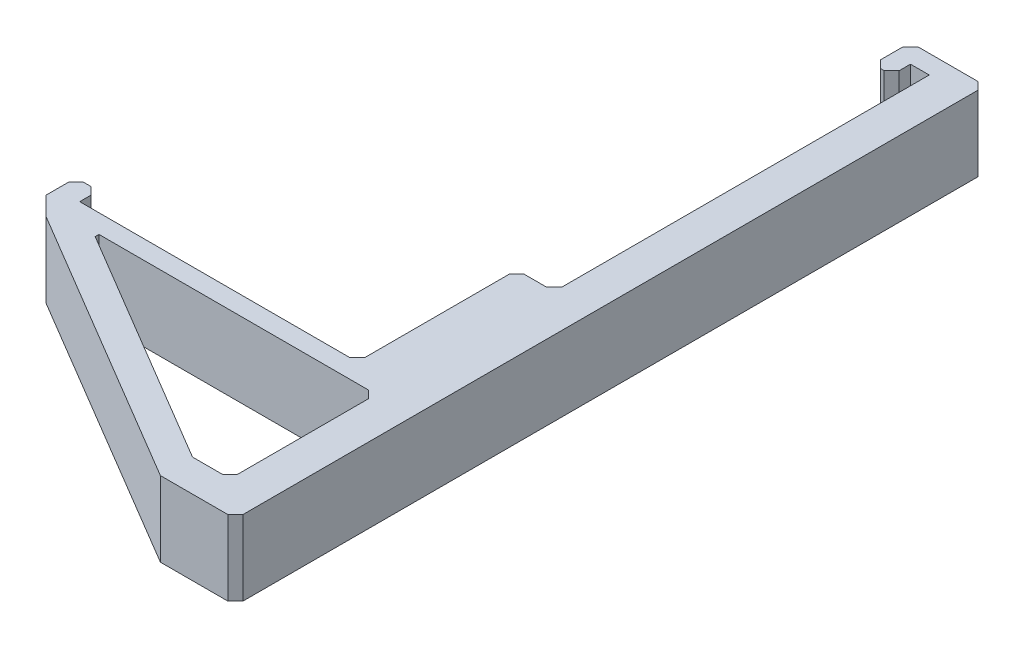
ISO-10303-21;
HEADER;
FILE_DESCRIPTION(('STEP AP214'),'2;1');
FILE_NAME('part.step','',(''),(''),'','','');
FILE_SCHEMA(('AUTOMOTIVE_DESIGN { 1 0 10303 214 1 1 1 1 }'));
ENDSEC;
DATA;
#1=APPLICATION_CONTEXT('core data for automotive mechanical design processes');
#2=APPLICATION_PROTOCOL_DEFINITION('international standard','automotive_design',2000,#1);
#3=PRODUCT_CONTEXT('',#1,'mechanical');
#4=PRODUCT('Part','Part','',(#3));
#5=PRODUCT_RELATED_PRODUCT_CATEGORY('part','',(#4));
#6=PRODUCT_DEFINITION_FORMATION('','',#4);
#7=PRODUCT_DEFINITION_CONTEXT('part definition',#1,'design');
#8=PRODUCT_DEFINITION('design','',#6,#7);
#9=PRODUCT_DEFINITION_SHAPE('','',#8);
#10=(LENGTH_UNIT() NAMED_UNIT(*) SI_UNIT(.MILLI.,.METRE.));
#11=(NAMED_UNIT(*) PLANE_ANGLE_UNIT() SI_UNIT($,.RADIAN.));
#12=(NAMED_UNIT(*) SI_UNIT($,.STERADIAN.) SOLID_ANGLE_UNIT());
#13=UNCERTAINTY_MEASURE_WITH_UNIT(LENGTH_MEASURE(1.E-05),#10,'distance_accuracy_value','');
#14=(GEOMETRIC_REPRESENTATION_CONTEXT(3) GLOBAL_UNCERTAINTY_ASSIGNED_CONTEXT((#13)) GLOBAL_UNIT_ASSIGNED_CONTEXT((#10,
#11,#12)) REPRESENTATION_CONTEXT('',''));
#15=CARTESIAN_POINT('',(0.,0.,0.));
#16=DIRECTION('',(0.,0.,1.));
#17=DIRECTION('',(1.,0.,0.));
#18=AXIS2_PLACEMENT_3D('',#15,#16,#17);
#19=CARTESIAN_POINT('',(0.,10.,0.));
#20=DIRECTION('',(0.,-1.,0.));
#21=DIRECTION('',(0.,0.,-1.));
#22=AXIS2_PLACEMENT_3D('',#19,#20,#21);
#23=PLANE('',#22);
#24=DIRECTION('',(1.,0.,0.));
#25=VECTOR('',#24,1.);
#26=CARTESIAN_POINT('',(-5.,10.,50.));
#27=LINE('',#26,#25);
#28=CARTESIAN_POINT('',(-5.,10.,50.));
#29=VERTEX_POINT('',#28);
#30=CARTESIAN_POINT('',(4.,10.,50.));
#31=VERTEX_POINT('',#30);
#32=EDGE_CURVE('E323',#29,#31,#27,.T.);
#33=ORIENTED_EDGE('',*,*,#32,.T.);
#34=DIRECTION('',(-0.707106781186548,0.,0.707106781186548));
#35=VECTOR('',#34,1.);
#36=CARTESIAN_POINT('',(5.,10.,49.));
#37=LINE('',#36,#35);
#38=CARTESIAN_POINT('',(5.,10.,49.));
#39=VERTEX_POINT('',#38);
#40=EDGE_CURVE('E428',#31,#39,#37,.F.);
#41=ORIENTED_EDGE('',*,*,#40,.T.);
#42=DIRECTION('',(0.,0.,-1.));
#43=VECTOR('',#42,1.);
#44=CARTESIAN_POINT('',(5.,10.,50.));
#45=LINE('',#44,#43);
#46=CARTESIAN_POINT('',(5.,10.,-49.));
#47=VERTEX_POINT('',#46);
#48=EDGE_CURVE('E284',#39,#47,#45,.T.);
#49=ORIENTED_EDGE('',*,*,#48,.T.);
#50=DIRECTION('',(0.70710678118655,0.,0.707106781186545));
#51=VECTOR('',#50,1.);
#52=CARTESIAN_POINT('',(3.99999999999998,10.,-50.));
#53=LINE('',#52,#51);
#54=CARTESIAN_POINT('',(3.99999999999998,10.,-50.));
#55=VERTEX_POINT('',#54);
#56=EDGE_CURVE('E426',#47,#55,#53,.F.);
#57=ORIENTED_EDGE('',*,*,#56,.T.);
#58=DIRECTION('',(-1.,0.,0.));
#59=VECTOR('',#58,1.);
#60=CARTESIAN_POINT('',(-5.,10.,-50.));
#61=LINE('',#60,#59);
#62=CARTESIAN_POINT('',(-3.99999999999999,10.,-50.));
#63=VERTEX_POINT('',#62);
#64=EDGE_CURVE('E287',#55,#63,#61,.T.);
#65=ORIENTED_EDGE('',*,*,#64,.T.);
#66=DIRECTION('',(0.707106781186552,0.,-0.707106781186543));
#67=VECTOR('',#66,1.);
#68=CARTESIAN_POINT('',(-5.,10.,-49.));
#69=LINE('',#68,#67);
#70=CARTESIAN_POINT('',(-5.,10.,-49.));
#71=VERTEX_POINT('',#70);
#72=EDGE_CURVE('E424',#63,#71,#69,.F.);
#73=ORIENTED_EDGE('',*,*,#72,.T.);
#74=DIRECTION('',(0.,0.,1.));
#75=VECTOR('',#74,1.);
#76=CARTESIAN_POINT('',(-5.,10.,-45.));
#77=LINE('',#76,#75);
#78=CARTESIAN_POINT('',(-5.,10.,-46.));
#79=VERTEX_POINT('',#78);
#80=EDGE_CURVE('E291',#71,#79,#77,.T.);
#81=ORIENTED_EDGE('',*,*,#80,.T.);
#82=DIRECTION('',(-0.707106781186548,0.,-0.707106781186548));
#83=VECTOR('',#82,1.);
#84=CARTESIAN_POINT('',(-3.99999999999996,10.,-45.));
#85=LINE('',#84,#83);
#86=CARTESIAN_POINT('',(-3.99999999999996,10.,-45.));
#87=VERTEX_POINT('',#86);
#88=EDGE_CURVE('E420',#79,#87,#85,.F.);
#89=ORIENTED_EDGE('',*,*,#88,.T.);
#90=DIRECTION('',(1.,0.,0.));
#91=VECTOR('',#90,1.);
#92=CARTESIAN_POINT('',(-2.5,10.,-45.));
#93=LINE('',#92,#91);
#94=CARTESIAN_POINT('',(-3.50000000000001,10.,-45.));
#95=VERTEX_POINT('',#94);
#96=EDGE_CURVE('E294',#87,#95,#93,.T.);
#97=ORIENTED_EDGE('',*,*,#96,.T.);
#98=DIRECTION('',(-0.707106781186552,0.,0.707106781186543));
#99=VECTOR('',#98,1.);
#100=CARTESIAN_POINT('',(-2.5,10.,-46.));
#101=LINE('',#100,#99);
#102=CARTESIAN_POINT('',(-2.5,10.,-46.));
#103=VERTEX_POINT('',#102);
#104=EDGE_CURVE('E422',#95,#103,#101,.F.);
#105=ORIENTED_EDGE('',*,*,#104,.T.);
#106=DIRECTION('',(0.,0.,-1.));
#107=VECTOR('',#106,1.);
#108=CARTESIAN_POINT('',(-2.5,10.,-45.));
#109=LINE('',#108,#107);
#110=CARTESIAN_POINT('',(-2.5,10.,-47.5));
#111=VERTEX_POINT('',#110);
#112=EDGE_CURVE('E297',#103,#111,#109,.T.);
#113=ORIENTED_EDGE('',*,*,#112,.T.);
#114=DIRECTION('',(1.,0.,0.));
#115=VECTOR('',#114,1.);
#116=CARTESIAN_POINT('',(0.,10.,-47.5));
#117=LINE('',#116,#115);
#118=CARTESIAN_POINT('',(0.,10.,-47.5));
#119=VERTEX_POINT('',#118);
#120=EDGE_CURVE('E299',#111,#119,#117,.T.);
#121=ORIENTED_EDGE('',*,*,#120,.T.);
#122=DIRECTION('',(0.,0.,1.));
#123=VECTOR('',#122,1.);
#124=CARTESIAN_POINT('',(0.,10.,-45.));
#125=LINE('',#124,#123);
#126=CARTESIAN_POINT('',(0.,10.,1.50000000000002));
#127=VERTEX_POINT('',#126);
#128=EDGE_CURVE('E301',#119,#127,#125,.T.);
#129=ORIENTED_EDGE('',*,*,#128,.T.);
#130=DIRECTION('',(0.707106781186552,0.,-0.707106781186543));
#131=VECTOR('',#130,1.);
#132=CARTESIAN_POINT('',(0.75000000000001,10.,0.750000000000021));
#133=LINE('',#132,#131);
#134=CARTESIAN_POINT('',(-1.00000000000002,10.,2.50000000000002));
#135=VERTEX_POINT('',#134);
#136=EDGE_CURVE('E487',#127,#135,#133,.F.);
#137=ORIENTED_EDGE('',*,*,#136,.T.);
#138=DIRECTION('',(-1.,0.,0.));
#139=VECTOR('',#138,1.);
#140=CARTESIAN_POINT('',(0.,10.,2.50000000000002));
#141=LINE('',#140,#139);
#142=CARTESIAN_POINT('',(-4.,10.,2.50000000000002));
#143=VERTEX_POINT('',#142);
#144=EDGE_CURVE('E304',#135,#143,#141,.T.);
#145=ORIENTED_EDGE('',*,*,#144,.T.);
#146=DIRECTION('',(0.707106781186547,0.,-0.707106781186548));
#147=VECTOR('',#146,1.);
#148=CARTESIAN_POINT('',(-5.,10.,3.50000000000002));
#149=LINE('',#148,#147);
#150=CARTESIAN_POINT('',(-5.,10.,3.50000000000002));
#151=VERTEX_POINT('',#150);
#152=EDGE_CURVE('E418',#143,#151,#149,.F.);
#153=ORIENTED_EDGE('',*,*,#152,.T.);
#154=DIRECTION('',(0.,0.,1.));
#155=VECTOR('',#154,1.);
#156=CARTESIAN_POINT('',(-5.,10.,2.50000000000002));
#157=LINE('',#156,#155);
#158=CARTESIAN_POINT('',(-5.,10.,22.75));
#159=VERTEX_POINT('',#158);
#160=EDGE_CURVE('E307',#151,#159,#157,.T.);
#161=ORIENTED_EDGE('',*,*,#160,.T.);
#162=DIRECTION('',(0.707106781186552,0.,-0.707106781186543));
#163=VECTOR('',#162,1.);
#164=CARTESIAN_POINT('',(8.87500000000004,10.,8.87500000000017));
#165=LINE('',#164,#163);
#166=CARTESIAN_POINT('',(-6.00000000000001,10.,23.75));
#167=VERTEX_POINT('',#166);
#168=EDGE_CURVE('E11',#159,#167,#165,.F.);
#169=ORIENTED_EDGE('',*,*,#168,.T.);
#170=DIRECTION('',(-1.,0.,0.));
#171=VECTOR('',#170,1.);
#172=CARTESIAN_POINT('',(-5.,10.,23.75));
#173=LINE('',#172,#171);
#174=CARTESIAN_POINT('',(-42.0041080187701,10.,23.75));
#175=VERTEX_POINT('',#174);
#176=EDGE_CURVE('E310',#167,#175,#173,.T.);
#177=ORIENTED_EDGE('',*,*,#176,.T.);
#178=DIRECTION('',(0.,0.,-1.));
#179=VECTOR('',#178,1.);
#180=CARTESIAN_POINT('',(-42.0041080187701,10.,21.25));
#181=LINE('',#180,#179);
#182=CARTESIAN_POINT('',(-42.0041080187701,10.,22.25));
#183=VERTEX_POINT('',#182);
#184=EDGE_CURVE('E312',#175,#183,#181,.T.);
#185=ORIENTED_EDGE('',*,*,#184,.T.);
#186=DIRECTION('',(0.707106781186543,0.,0.707106781186552));
#187=VECTOR('',#186,1.);
#188=CARTESIAN_POINT('',(-43.0041080187701,10.,21.25));
#189=LINE('',#188,#187);
#190=CARTESIAN_POINT('',(-43.0041080187701,10.,21.25));
#191=VERTEX_POINT('',#190);
#192=EDGE_CURVE('E412',#183,#191,#189,.F.);
#193=ORIENTED_EDGE('',*,*,#192,.T.);
#194=DIRECTION('',(-1.,0.,0.));
#195=VECTOR('',#194,1.);
#196=CARTESIAN_POINT('',(-45.,10.,21.25));
#197=LINE('',#196,#195);
#198=CARTESIAN_POINT('',(-44.,10.,21.25));
#199=VERTEX_POINT('',#198);
#200=EDGE_CURVE('E315',#191,#199,#197,.T.);
#201=ORIENTED_EDGE('',*,*,#200,.T.);
#202=DIRECTION('',(0.707106781186548,0.,-0.707106781186548));
#203=VECTOR('',#202,1.);
#204=CARTESIAN_POINT('',(-45.,10.,22.25));
#205=LINE('',#204,#203);
#206=CARTESIAN_POINT('',(-45.,10.,22.25));
#207=VERTEX_POINT('',#206);
#208=EDGE_CURVE('E414',#199,#207,#205,.F.);
#209=ORIENTED_EDGE('',*,*,#208,.T.);
#210=DIRECTION('',(0.,0.,1.));
#211=VECTOR('',#210,1.);
#212=CARTESIAN_POINT('',(-45.,10.,26.25));
#213=LINE('',#212,#211);
#214=CARTESIAN_POINT('',(-45.,10.,25.25));
#215=VERTEX_POINT('',#214);
#216=EDGE_CURVE('E318',#207,#215,#213,.T.);
#217=ORIENTED_EDGE('',*,*,#216,.T.);
#218=DIRECTION('',(-0.707106781186544,0.,-0.707106781186552));
#219=VECTOR('',#218,1.);
#220=CARTESIAN_POINT('',(-42.5384615384616,10.,27.7115384615384));
#221=LINE('',#220,#219);
#222=CARTESIAN_POINT('',(-42.5384615384616,10.,27.7115384615384));
#223=VERTEX_POINT('',#222);
#224=EDGE_CURVE('E416',#215,#223,#221,.F.);
#225=ORIENTED_EDGE('',*,*,#224,.T.);
#226=DIRECTION('',(0.859854743840735,0.,0.510538754155436));
#227=VECTOR('',#226,1.);
#228=CARTESIAN_POINT('',(-45.,10.,26.25));
#229=LINE('',#228,#227);
#230=EDGE_CURVE('E321',#223,#29,#229,.T.);
#231=ORIENTED_EDGE('',*,*,#230,.T.);
#232=EDGE_LOOP('',(#33,#41,#49,#57,#65,#73,#81,#89,#97,#105,#113,#121,#129,#137,#145,#153,#161,
#169,#177,#185,#193,#201,#209,#217,#225,#231));
#233=FACE_BOUND('',#232,.T.);
#234=DIRECTION('',(0.,0.,-1.));
#235=VECTOR('',#234,1.);
#236=CARTESIAN_POINT('',(0.,10.,26.25));
#237=LINE('',#236,#235);
#238=CARTESIAN_POINT('',(0.,10.,44.7211891361448));
#239=VERTEX_POINT('',#238);
#240=CARTESIAN_POINT('',(0.,10.,27.25));
#241=VERTEX_POINT('',#240);
#242=EDGE_CURVE('E277',#239,#241,#237,.T.);
#243=ORIENTED_EDGE('',*,*,#242,.F.);
#244=DIRECTION('',(0.707106781186552,0.,-0.707106781186543));
#245=VECTOR('',#244,1.);
#246=CARTESIAN_POINT('',(22.3605945680724,10.,22.3605945680727));
#247=LINE('',#246,#245);
#248=CARTESIAN_POINT('',(-1.00000000000001,10.,45.7211891361448));
#249=VERTEX_POINT('',#248);
#250=EDGE_CURVE('E59',#239,#249,#247,.F.);
#251=ORIENTED_EDGE('',*,*,#250,.T.);
#252=DIRECTION('',(1.,0.,0.));
#253=VECTOR('',#252,1.);
#254=CARTESIAN_POINT('',(-5.,10.,45.7211891361448));
#255=LINE('',#254,#253);
#256=CARTESIAN_POINT('',(-5.,10.,45.7211891361448));
#257=VERTEX_POINT('',#256);
#258=EDGE_CURVE('E271',#257,#249,#255,.T.);
#259=ORIENTED_EDGE('',*,*,#258,.F.);
#260=DIRECTION('',(0.859854743840734,0.,0.510538754155436));
#261=VECTOR('',#260,1.);
#262=CARTESIAN_POINT('',(-37.7935817029806,10.,26.25));
#263=LINE('',#262,#261);
#264=CARTESIAN_POINT('',(-36.9337269591399,10.,26.7605387541555));
#265=VERTEX_POINT('',#264);
#266=EDGE_CURVE('E268',#265,#257,#263,.T.);
#267=ORIENTED_EDGE('',*,*,#266,.F.);
#268=DIRECTION('',(-0.0122121587947025,0.,0.999925428808355));
#269=VECTOR('',#268,1.);
#270=CARTESIAN_POINT('',(-36.6014392019232,10.,-0.447015922158533));
#271=LINE('',#270,#269);
#272=CARTESIAN_POINT('',(-36.9274917138336,10.,26.25));
#273=VERTEX_POINT('',#272);
#274=EDGE_CURVE('E384',#265,#273,#271,.F.);
#275=ORIENTED_EDGE('',*,*,#274,.T.);
#276=DIRECTION('',(-1.,0.,0.));
#277=VECTOR('',#276,1.);
#278=CARTESIAN_POINT('',(-37.7935817029806,10.,26.25));
#279=LINE('',#278,#277);
#280=CARTESIAN_POINT('',(-1.,10.,26.25));
#281=VERTEX_POINT('',#280);
#282=EDGE_CURVE('E280',#281,#273,#279,.T.);
#283=ORIENTED_EDGE('',*,*,#282,.F.);
#284=DIRECTION('',(-0.707106781186542,0.,-0.707106781186553));
#285=VECTOR('',#284,1.);
#286=CARTESIAN_POINT('',(-13.625,10.,13.6249999999998));
#287=LINE('',#286,#285);
#288=EDGE_CURVE('E494',#281,#241,#287,.F.);
#289=ORIENTED_EDGE('',*,*,#288,.T.);
#290=EDGE_LOOP('',(#243,#251,#259,#267,#275,#283,#289));
#291=FACE_BOUND('',#290,.T.);
#292=ADVANCED_FACE('F35',(#233,#291),#23,.F.);
#293=CARTESIAN_POINT('',(0.,0.,0.));
#294=DIRECTION('',(0.,-1.,0.));
#295=DIRECTION('',(0.,0.,-1.));
#296=AXIS2_PLACEMENT_3D('',#293,#294,#295);
#297=PLANE('',#296);
#298=DIRECTION('',(0.,0.,-1.));
#299=VECTOR('',#298,1.);
#300=CARTESIAN_POINT('',(5.,0.,50.));
#301=LINE('',#300,#299);
#302=CARTESIAN_POINT('',(5.,0.,49.));
#303=VERTEX_POINT('',#302);
#304=CARTESIAN_POINT('',(5.,0.,-49.));
#305=VERTEX_POINT('',#304);
#306=EDGE_CURVE('E270',#303,#305,#301,.T.);
#307=ORIENTED_EDGE('',*,*,#306,.F.);
#308=DIRECTION('',(0.707106781186548,0.,-0.707106781186548));
#309=VECTOR('',#308,1.);
#310=CARTESIAN_POINT('',(27.,0.,27.));
#311=LINE('',#310,#309);
#312=CARTESIAN_POINT('',(4.,0.,50.));
#313=VERTEX_POINT('',#312);
#314=EDGE_CURVE('E408',#303,#313,#311,.F.);
#315=ORIENTED_EDGE('',*,*,#314,.T.);
#316=DIRECTION('',(1.,0.,0.));
#317=VECTOR('',#316,1.);
#318=CARTESIAN_POINT('',(-5.,0.,50.));
#319=LINE('',#318,#317);
#320=CARTESIAN_POINT('',(-5.,0.,50.));
#321=VERTEX_POINT('',#320);
#322=EDGE_CURVE('E288',#321,#313,#319,.T.);
#323=ORIENTED_EDGE('',*,*,#322,.F.);
#324=DIRECTION('',(0.859854743840735,0.,0.510538754155436));
#325=VECTOR('',#324,1.);
#326=CARTESIAN_POINT('',(-45.,0.,26.25));
#327=LINE('',#326,#325);
#328=CARTESIAN_POINT('',(-42.5384615384616,0.,27.7115384615384));
#329=VERTEX_POINT('',#328);
#330=EDGE_CURVE('E363',#329,#321,#327,.T.);
#331=ORIENTED_EDGE('',*,*,#330,.F.);
#332=DIRECTION('',(0.707106781186544,0.,0.707106781186552));
#333=VECTOR('',#332,1.);
#334=CARTESIAN_POINT('',(-35.1250000000003,0.,35.1249999999999));
#335=LINE('',#334,#333);
#336=CARTESIAN_POINT('',(-45.,0.,25.25));
#337=VERTEX_POINT('',#336);
#338=EDGE_CURVE('E396',#329,#337,#335,.F.);
#339=ORIENTED_EDGE('',*,*,#338,.T.);
#340=DIRECTION('',(0.,0.,1.));
#341=VECTOR('',#340,1.);
#342=CARTESIAN_POINT('',(-45.,0.,26.25));
#343=LINE('',#342,#341);
#344=CARTESIAN_POINT('',(-45.,0.,22.25));
#345=VERTEX_POINT('',#344);
#346=EDGE_CURVE('E360',#345,#337,#343,.T.);
#347=ORIENTED_EDGE('',*,*,#346,.F.);
#348=DIRECTION('',(-0.707106781186548,0.,0.707106781186548));
#349=VECTOR('',#348,1.);
#350=CARTESIAN_POINT('',(-11.375,0.,-11.375));
#351=LINE('',#350,#349);
#352=CARTESIAN_POINT('',(-44.,0.,21.25));
#353=VERTEX_POINT('',#352);
#354=EDGE_CURVE('E394',#345,#353,#351,.F.);
#355=ORIENTED_EDGE('',*,*,#354,.T.);
#356=DIRECTION('',(-1.,0.,0.));
#357=VECTOR('',#356,1.);
#358=CARTESIAN_POINT('',(-45.,0.,21.25));
#359=LINE('',#358,#357);
#360=CARTESIAN_POINT('',(-43.0041080187701,0.,21.25));
#361=VERTEX_POINT('',#360);
#362=EDGE_CURVE('E357',#361,#353,#359,.T.);
#363=ORIENTED_EDGE('',*,*,#362,.F.);
#364=DIRECTION('',(-0.707106781186543,0.,-0.707106781186552));
#365=VECTOR('',#364,1.);
#366=CARTESIAN_POINT('',(-32.1270540093854,0.,32.1270540093849));
#367=LINE('',#366,#365);
#368=CARTESIAN_POINT('',(-42.0041080187701,0.,22.25));
#369=VERTEX_POINT('',#368);
#370=EDGE_CURVE('E392',#361,#369,#367,.F.);
#371=ORIENTED_EDGE('',*,*,#370,.T.);
#372=DIRECTION('',(0.,0.,-1.));
#373=VECTOR('',#372,1.);
#374=CARTESIAN_POINT('',(-42.0041080187701,0.,21.25));
#375=LINE('',#374,#373);
#376=CARTESIAN_POINT('',(-42.0041080187701,0.,23.75));
#377=VERTEX_POINT('',#376);
#378=EDGE_CURVE('E354',#377,#369,#375,.T.);
#379=ORIENTED_EDGE('',*,*,#378,.F.);
#380=DIRECTION('',(-1.,0.,0.));
#381=VECTOR('',#380,1.);
#382=CARTESIAN_POINT('',(-5.,0.,23.75));
#383=LINE('',#382,#381);
#384=CARTESIAN_POINT('',(-6.00000000000001,0.,23.75));
#385=VERTEX_POINT('',#384);
#386=EDGE_CURVE('E352',#385,#377,#383,.T.);
#387=ORIENTED_EDGE('',*,*,#386,.F.);
#388=DIRECTION('',(-0.707106781186552,0.,0.707106781186543));
#389=VECTOR('',#388,1.);
#390=CARTESIAN_POINT('',(-6.00000000000001,0.,23.75));
#391=LINE('',#390,#389);
#392=CARTESIAN_POINT('',(-5.,0.,22.75));
#393=VERTEX_POINT('',#392);
#394=EDGE_CURVE('E44',#385,#393,#391,.F.);
#395=ORIENTED_EDGE('',*,*,#394,.T.);
#396=DIRECTION('',(0.,0.,1.));
#397=VECTOR('',#396,1.);
#398=CARTESIAN_POINT('',(-5.,0.,21.25));
#399=LINE('',#398,#397);
#400=CARTESIAN_POINT('',(-5.,0.,3.50000000000002));
#401=VERTEX_POINT('',#400);
#402=EDGE_CURVE('E349',#401,#393,#399,.T.);
#403=ORIENTED_EDGE('',*,*,#402,.F.);
#404=DIRECTION('',(-0.707106781186547,0.,0.707106781186548));
#405=VECTOR('',#404,1.);
#406=CARTESIAN_POINT('',(-0.749999999999989,0.,-0.749999999999988));
#407=LINE('',#406,#405);
#408=CARTESIAN_POINT('',(-4.,0.,2.50000000000002));
#409=VERTEX_POINT('',#408);
#410=EDGE_CURVE('E398',#401,#409,#407,.F.);
#411=ORIENTED_EDGE('',*,*,#410,.T.);
#412=DIRECTION('',(-1.,0.,0.));
#413=VECTOR('',#412,1.);
#414=CARTESIAN_POINT('',(0.,0.,2.50000000000002));
#415=LINE('',#414,#413);
#416=CARTESIAN_POINT('',(-1.00000000000002,0.,2.50000000000002));
#417=VERTEX_POINT('',#416);
#418=EDGE_CURVE('E346',#417,#409,#415,.T.);
#419=ORIENTED_EDGE('',*,*,#418,.F.);
#420=DIRECTION('',(-0.707106781186552,0.,0.707106781186543));
#421=VECTOR('',#420,1.);
#422=CARTESIAN_POINT('',(-1.00000000000002,0.,2.50000000000002));
#423=LINE('',#422,#421);
#424=CARTESIAN_POINT('',(0.,0.,1.50000000000002));
#425=VERTEX_POINT('',#424);
#426=EDGE_CURVE('E485',#417,#425,#423,.F.);
#427=ORIENTED_EDGE('',*,*,#426,.T.);
#428=DIRECTION('',(0.,0.,1.));
#429=VECTOR('',#428,1.);
#430=CARTESIAN_POINT('',(0.,0.,0.));
#431=LINE('',#430,#429);
#432=CARTESIAN_POINT('',(0.,0.,-47.5));
#433=VERTEX_POINT('',#432);
#434=EDGE_CURVE('E343',#433,#425,#431,.T.);
#435=ORIENTED_EDGE('',*,*,#434,.F.);
#436=DIRECTION('',(1.,0.,0.));
#437=VECTOR('',#436,1.);
#438=CARTESIAN_POINT('',(0.,0.,-47.5));
#439=LINE('',#438,#437);
#440=CARTESIAN_POINT('',(-2.5,0.,-47.5));
#441=VERTEX_POINT('',#440);
#442=EDGE_CURVE('E340',#441,#433,#439,.T.);
#443=ORIENTED_EDGE('',*,*,#442,.F.);
#444=DIRECTION('',(0.,0.,-1.));
#445=VECTOR('',#444,1.);
#446=CARTESIAN_POINT('',(-2.5,0.,-45.));
#447=LINE('',#446,#445);
#448=CARTESIAN_POINT('',(-2.5,0.,-46.));
#449=VERTEX_POINT('',#448);
#450=EDGE_CURVE('E338',#449,#441,#447,.T.);
#451=ORIENTED_EDGE('',*,*,#450,.F.);
#452=DIRECTION('',(0.707106781186552,0.,-0.707106781186543));
#453=VECTOR('',#452,1.);
#454=CARTESIAN_POINT('',(-24.25,0.,-24.2500000000003));
#455=LINE('',#454,#453);
#456=CARTESIAN_POINT('',(-3.50000000000001,0.,-45.));
#457=VERTEX_POINT('',#456);
#458=EDGE_CURVE('E402',#449,#457,#455,.F.);
#459=ORIENTED_EDGE('',*,*,#458,.T.);
#460=DIRECTION('',(1.,0.,0.));
#461=VECTOR('',#460,1.);
#462=CARTESIAN_POINT('',(-2.5,0.,-45.));
#463=LINE('',#462,#461);
#464=CARTESIAN_POINT('',(-3.99999999999996,0.,-45.));
#465=VERTEX_POINT('',#464);
#466=EDGE_CURVE('E335',#465,#457,#463,.T.);
#467=ORIENTED_EDGE('',*,*,#466,.F.);
#468=DIRECTION('',(0.707106781186548,0.,0.707106781186548));
#469=VECTOR('',#468,1.);
#470=CARTESIAN_POINT('',(20.5,0.,-20.5));
#471=LINE('',#470,#469);
#472=CARTESIAN_POINT('',(-5.,0.,-46.));
#473=VERTEX_POINT('',#472);
#474=EDGE_CURVE('E400',#465,#473,#471,.F.);
#475=ORIENTED_EDGE('',*,*,#474,.T.);
#476=DIRECTION('',(0.,0.,1.));
#477=VECTOR('',#476,1.);
#478=CARTESIAN_POINT('',(-5.,0.,-45.));
#479=LINE('',#478,#477);
#480=CARTESIAN_POINT('',(-5.,0.,-49.));
#481=VERTEX_POINT('',#480);
#482=EDGE_CURVE('E332',#481,#473,#479,.T.);
#483=ORIENTED_EDGE('',*,*,#482,.F.);
#484=DIRECTION('',(-0.707106781186552,0.,0.707106781186543));
#485=VECTOR('',#484,1.);
#486=CARTESIAN_POINT('',(-27.,0.,-27.0000000000003));
#487=LINE('',#486,#485);
#488=CARTESIAN_POINT('',(-3.99999999999999,0.,-50.));
#489=VERTEX_POINT('',#488);
#490=EDGE_CURVE('E404',#481,#489,#487,.F.);
#491=ORIENTED_EDGE('',*,*,#490,.T.);
#492=DIRECTION('',(-1.,0.,0.));
#493=VECTOR('',#492,1.);
#494=CARTESIAN_POINT('',(-5.,0.,-50.));
#495=LINE('',#494,#493);
#496=CARTESIAN_POINT('',(3.99999999999998,0.,-50.));
#497=VERTEX_POINT('',#496);
#498=EDGE_CURVE('E329',#497,#489,#495,.T.);
#499=ORIENTED_EDGE('',*,*,#498,.F.);
#500=DIRECTION('',(-0.70710678118655,0.,-0.707106781186545));
#501=VECTOR('',#500,1.);
#502=CARTESIAN_POINT('',(27.,0.,-27.0000000000002));
#503=LINE('',#502,#501);
#504=EDGE_CURVE('E406',#497,#305,#503,.F.);
#505=ORIENTED_EDGE('',*,*,#504,.T.);
#506=EDGE_LOOP('',(#307,#315,#323,#331,#339,#347,#355,#363,#371,#379,#387,#395,#403,#411,#419,
#427,#435,#443,#451,#459,#467,#475,#483,#491,#499,#505));
#507=FACE_BOUND('',#506,.T.);
#508=DIRECTION('',(1.,0.,0.));
#509=VECTOR('',#508,1.);
#510=CARTESIAN_POINT('',(-5.,0.,45.7211891361448));
#511=LINE('',#510,#509);
#512=CARTESIAN_POINT('',(-5.,0.,45.7211891361448));
#513=VERTEX_POINT('',#512);
#514=CARTESIAN_POINT('',(-1.00000000000001,0.,45.7211891361448));
#515=VERTEX_POINT('',#514);
#516=EDGE_CURVE('E257',#513,#515,#511,.T.);
#517=ORIENTED_EDGE('',*,*,#516,.T.);
#518=DIRECTION('',(-0.707106781186552,0.,0.707106781186543));
#519=VECTOR('',#518,1.);
#520=CARTESIAN_POINT('',(-1.00000000000001,0.,45.7211891361448));
#521=LINE('',#520,#519);
#522=CARTESIAN_POINT('',(0.,0.,44.7211891361448));
#523=VERTEX_POINT('',#522);
#524=EDGE_CURVE('E489',#515,#523,#521,.F.);
#525=ORIENTED_EDGE('',*,*,#524,.T.);
#526=DIRECTION('',(0.,0.,-1.));
#527=VECTOR('',#526,1.);
#528=CARTESIAN_POINT('',(0.,0.,26.25));
#529=LINE('',#528,#527);
#530=CARTESIAN_POINT('',(0.,0.,27.25));
#531=VERTEX_POINT('',#530);
#532=EDGE_CURVE('E742',#523,#531,#529,.T.);
#533=ORIENTED_EDGE('',*,*,#532,.T.);
#534=DIRECTION('',(0.707106781186542,0.,0.707106781186553));
#535=VECTOR('',#534,1.);
#536=CARTESIAN_POINT('',(0.,0.,27.25));
#537=LINE('',#536,#535);
#538=CARTESIAN_POINT('',(-1.,0.,26.25));
#539=VERTEX_POINT('',#538);
#540=EDGE_CURVE('E492',#531,#539,#537,.F.);
#541=ORIENTED_EDGE('',*,*,#540,.T.);
#542=DIRECTION('',(-1.,0.,0.));
#543=VECTOR('',#542,1.);
#544=CARTESIAN_POINT('',(-37.7935817029806,0.,26.25));
#545=LINE('',#544,#543);
#546=CARTESIAN_POINT('',(-36.9274917138336,0.,26.25));
#547=VERTEX_POINT('',#546);
#548=EDGE_CURVE('E262',#539,#547,#545,.T.);
#549=ORIENTED_EDGE('',*,*,#548,.T.);
#550=DIRECTION('',(0.0122121587947025,0.,-0.999925428808355));
#551=VECTOR('',#550,1.);
#552=CARTESIAN_POINT('',(-36.9274917138336,0.,26.25));
#553=LINE('',#552,#551);
#554=CARTESIAN_POINT('',(-36.9337269591399,0.,26.7605387541555));
#555=VERTEX_POINT('',#554);
#556=EDGE_CURVE('E259',#547,#555,#553,.F.);
#557=ORIENTED_EDGE('',*,*,#556,.T.);
#558=DIRECTION('',(0.859854743840734,0.,0.510538754155436));
#559=VECTOR('',#558,1.);
#560=CARTESIAN_POINT('',(-37.7935817029806,0.,26.25));
#561=LINE('',#560,#559);
#562=EDGE_CURVE('E253',#555,#513,#561,.T.);
#563=ORIENTED_EDGE('',*,*,#562,.T.);
#564=EDGE_LOOP('',(#517,#525,#533,#541,#549,#557,#563));
#565=FACE_BOUND('',#564,.T.);
#566=ADVANCED_FACE('F255',(#507,#565),#297,.T.);
#567=CARTESIAN_POINT('',(5.,10.,50.));
#568=DIRECTION('',(-1.,0.,0.));
#569=DIRECTION('',(0.,0.,1.));
#570=AXIS2_PLACEMENT_3D('',#567,#568,#569);
#571=PLANE('',#570);
#572=ORIENTED_EDGE('',*,*,#48,.F.);
#573=DIRECTION('',(0.,-1.,0.));
#574=VECTOR('',#573,1.);
#575=CARTESIAN_POINT('',(5.,10.,49.));
#576=LINE('',#575,#574);
#577=EDGE_CURVE('E389',#39,#303,#576,.T.);
#578=ORIENTED_EDGE('',*,*,#577,.T.);
#579=ORIENTED_EDGE('',*,*,#306,.T.);
#580=DIRECTION('',(0.,1.,0.));
#581=VECTOR('',#580,1.);
#582=CARTESIAN_POINT('',(5.,10.,-49.));
#583=LINE('',#582,#581);
#584=EDGE_CURVE('E387',#305,#47,#583,.T.);
#585=ORIENTED_EDGE('',*,*,#584,.T.);
#586=EDGE_LOOP('',(#572,#578,#579,#585));
#587=FACE_BOUND('',#586,.T.);
#588=ADVANCED_FACE('F556',(#587),#571,.F.);
#589=CARTESIAN_POINT('',(-5.,10.,-50.));
#590=DIRECTION('',(0.,0.,1.));
#591=DIRECTION('',(1.,0.,0.));
#592=AXIS2_PLACEMENT_3D('',#589,#590,#591);
#593=PLANE('',#592);
#594=ORIENTED_EDGE('',*,*,#64,.F.);
#595=DIRECTION('',(0.,-1.,0.));
#596=VECTOR('',#595,1.);
#597=CARTESIAN_POINT('',(3.99999999999998,10.,-50.));
#598=LINE('',#597,#596);
#599=EDGE_CURVE('E432',#55,#497,#598,.T.);
#600=ORIENTED_EDGE('',*,*,#599,.T.);
#601=ORIENTED_EDGE('',*,*,#498,.T.);
#602=DIRECTION('',(0.,1.,0.));
#603=VECTOR('',#602,1.);
#604=CARTESIAN_POINT('',(-3.99999999999999,10.,-50.));
#605=LINE('',#604,#603);
#606=EDGE_CURVE('E430',#489,#63,#605,.T.);
#607=ORIENTED_EDGE('',*,*,#606,.T.);
#608=EDGE_LOOP('',(#594,#600,#601,#607));
#609=FACE_BOUND('',#608,.T.);
#610=ADVANCED_FACE('F564',(#609),#593,.F.);
#611=CARTESIAN_POINT('',(-5.,10.,-45.));
#612=DIRECTION('',(1.,0.,0.));
#613=DIRECTION('',(0.,0.,-1.));
#614=AXIS2_PLACEMENT_3D('',#611,#612,#613);
#615=PLANE('',#614);
#616=ORIENTED_EDGE('',*,*,#80,.F.);
#617=DIRECTION('',(0.,-1.,0.));
#618=VECTOR('',#617,1.);
#619=CARTESIAN_POINT('',(-5.,10.,-49.));
#620=LINE('',#619,#618);
#621=EDGE_CURVE('E437',#71,#481,#620,.T.);
#622=ORIENTED_EDGE('',*,*,#621,.T.);
#623=ORIENTED_EDGE('',*,*,#482,.T.);
#624=DIRECTION('',(0.,1.,0.));
#625=VECTOR('',#624,1.);
#626=CARTESIAN_POINT('',(-5.,10.,-46.));
#627=LINE('',#626,#625);
#628=EDGE_CURVE('E435',#473,#79,#627,.T.);
#629=ORIENTED_EDGE('',*,*,#628,.T.);
#630=EDGE_LOOP('',(#616,#622,#623,#629));
#631=FACE_BOUND('',#630,.T.);
#632=ADVANCED_FACE('F573',(#631),#615,.F.);
#633=CARTESIAN_POINT('',(-2.5,10.,-45.));
#634=DIRECTION('',(0.,0.,-1.));
#635=DIRECTION('',(-1.,0.,0.));
#636=AXIS2_PLACEMENT_3D('',#633,#634,#635);
#637=PLANE('',#636);
#638=ORIENTED_EDGE('',*,*,#466,.T.);
#639=DIRECTION('',(0.,1.,0.));
#640=VECTOR('',#639,1.);
#641=CARTESIAN_POINT('',(-3.50000000000001,10.,-45.));
#642=LINE('',#641,#640);
#643=EDGE_CURVE('E446',#457,#95,#642,.T.);
#644=ORIENTED_EDGE('',*,*,#643,.T.);
#645=ORIENTED_EDGE('',*,*,#96,.F.);
#646=DIRECTION('',(0.,-1.,0.));
#647=VECTOR('',#646,1.);
#648=CARTESIAN_POINT('',(-3.99999999999996,10.,-45.));
#649=LINE('',#648,#647);
#650=EDGE_CURVE('E443',#87,#465,#649,.T.);
#651=ORIENTED_EDGE('',*,*,#650,.T.);
#652=EDGE_LOOP('',(#638,#644,#645,#651));
#653=FACE_BOUND('',#652,.T.);
#654=ADVANCED_FACE('F582',(#653),#637,.F.);
#655=CARTESIAN_POINT('',(-2.5,10.,-45.));
#656=DIRECTION('',(-1.,0.,0.));
#657=DIRECTION('',(0.,0.,1.));
#658=AXIS2_PLACEMENT_3D('',#655,#656,#657);
#659=PLANE('',#658);
#660=ORIENTED_EDGE('',*,*,#112,.F.);
#661=DIRECTION('',(0.,-1.,0.));
#662=VECTOR('',#661,1.);
#663=CARTESIAN_POINT('',(-2.5,10.,-46.));
#664=LINE('',#663,#662);
#665=EDGE_CURVE('E440',#103,#449,#664,.T.);
#666=ORIENTED_EDGE('',*,*,#665,.T.);
#667=ORIENTED_EDGE('',*,*,#450,.T.);
#668=DIRECTION('',(0.,-1.,0.));
#669=VECTOR('',#668,1.);
#670=CARTESIAN_POINT('',(-2.5,10.,-47.5));
#671=LINE('',#670,#669);
#672=EDGE_CURVE('E375',#111,#441,#671,.T.);
#673=ORIENTED_EDGE('',*,*,#672,.F.);
#674=EDGE_LOOP('',(#660,#666,#667,#673));
#675=FACE_BOUND('',#674,.T.);
#676=ADVANCED_FACE('F591',(#675),#659,.F.);
#677=CARTESIAN_POINT('',(0.,10.,-47.5));
#678=DIRECTION('',(0.,0.,-1.));
#679=DIRECTION('',(-1.,0.,0.));
#680=AXIS2_PLACEMENT_3D('',#677,#678,#679);
#681=PLANE('',#680);
#682=ORIENTED_EDGE('',*,*,#442,.T.);
#683=DIRECTION('',(0.,-1.,0.));
#684=VECTOR('',#683,1.);
#685=CARTESIAN_POINT('',(0.,10.,-47.5));
#686=LINE('',#685,#684);
#687=EDGE_CURVE('E372',#119,#433,#686,.T.);
#688=ORIENTED_EDGE('',*,*,#687,.F.);
#689=ORIENTED_EDGE('',*,*,#120,.F.);
#690=ORIENTED_EDGE('',*,*,#672,.T.);
#691=EDGE_LOOP('',(#682,#688,#689,#690));
#692=FACE_BOUND('',#691,.T.);
#693=ADVANCED_FACE('F597',(#692),#681,.F.);
#694=CARTESIAN_POINT('',(0.,10.,0.));
#695=DIRECTION('',(1.,0.,0.));
#696=DIRECTION('',(0.,0.,-1.));
#697=AXIS2_PLACEMENT_3D('',#694,#695,#696);
#698=PLANE('',#697);
#699=ORIENTED_EDGE('',*,*,#434,.T.);
#700=DIRECTION('',(0.,1.,0.));
#701=VECTOR('',#700,1.);
#702=CARTESIAN_POINT('',(0.,10.,1.50000000000002));
#703=LINE('',#702,#701);
#704=EDGE_CURVE('E453',#425,#127,#703,.T.);
#705=ORIENTED_EDGE('',*,*,#704,.T.);
#706=ORIENTED_EDGE('',*,*,#128,.F.);
#707=ORIENTED_EDGE('',*,*,#687,.T.);
#708=EDGE_LOOP('',(#699,#705,#706,#707));
#709=FACE_BOUND('',#708,.T.);
#710=ADVANCED_FACE('F651',(#709),#698,.F.);
#711=CARTESIAN_POINT('',(0.,10.,2.50000000000002));
#712=DIRECTION('',(0.,0.,1.));
#713=DIRECTION('',(1.,0.,0.));
#714=AXIS2_PLACEMENT_3D('',#711,#712,#713);
#715=PLANE('',#714);
#716=ORIENTED_EDGE('',*,*,#144,.F.);
#717=DIRECTION('',(0.,-1.,0.));
#718=VECTOR('',#717,1.);
#719=CARTESIAN_POINT('',(-1.00000000000002,0.,2.50000000000002));
#720=LINE('',#719,#718);
#721=EDGE_CURVE('E450',#135,#417,#720,.T.);
#722=ORIENTED_EDGE('',*,*,#721,.T.);
#723=ORIENTED_EDGE('',*,*,#418,.T.);
#724=DIRECTION('',(0.,1.,0.));
#725=VECTOR('',#724,1.);
#726=CARTESIAN_POINT('',(-4.,10.,2.50000000000002));
#727=LINE('',#726,#725);
#728=EDGE_CURVE('E448',#409,#143,#727,.T.);
#729=ORIENTED_EDGE('',*,*,#728,.T.);
#730=EDGE_LOOP('',(#716,#722,#723,#729));
#731=FACE_BOUND('',#730,.T.);
#732=ADVANCED_FACE('F608',(#731),#715,.F.);
#733=CARTESIAN_POINT('',(-5.,10.,21.25));
#734=DIRECTION('',(1.,0.,0.));
#735=DIRECTION('',(0.,0.,-1.));
#736=AXIS2_PLACEMENT_3D('',#733,#734,#735);
#737=PLANE('',#736);
#738=ORIENTED_EDGE('',*,*,#160,.F.);
#739=DIRECTION('',(0.,-1.,0.));
#740=VECTOR('',#739,1.);
#741=CARTESIAN_POINT('',(-5.,10.,3.50000000000002));
#742=LINE('',#741,#740);
#743=EDGE_CURVE('E457',#151,#401,#742,.T.);
#744=ORIENTED_EDGE('',*,*,#743,.T.);
#745=ORIENTED_EDGE('',*,*,#402,.T.);
#746=DIRECTION('',(0.,1.,0.));
#747=VECTOR('',#746,1.);
#748=CARTESIAN_POINT('',(-5.,10.,22.75));
#749=LINE('',#748,#747);
#750=EDGE_CURVE('E455',#393,#159,#749,.T.);
#751=ORIENTED_EDGE('',*,*,#750,.T.);
#752=EDGE_LOOP('',(#738,#744,#745,#751));
#753=FACE_BOUND('',#752,.T.);
#754=ADVANCED_FACE('F505',(#753),#737,.F.);
#755=CARTESIAN_POINT('',(-5.,10.,23.75));
#756=DIRECTION('',(0.,0.,1.));
#757=DIRECTION('',(1.,0.,0.));
#758=AXIS2_PLACEMENT_3D('',#755,#756,#757);
#759=PLANE('',#758);
#760=ORIENTED_EDGE('',*,*,#176,.F.);
#761=DIRECTION('',(0.,-1.,0.));
#762=VECTOR('',#761,1.);
#763=CARTESIAN_POINT('',(-6.00000000000001,0.,23.75));
#764=LINE('',#763,#762);
#765=EDGE_CURVE('E467',#167,#385,#764,.T.);
#766=ORIENTED_EDGE('',*,*,#765,.T.);
#767=ORIENTED_EDGE('',*,*,#386,.T.);
#768=DIRECTION('',(0.,-1.,0.));
#769=VECTOR('',#768,1.);
#770=CARTESIAN_POINT('',(-42.0041080187701,10.,23.75));
#771=LINE('',#770,#769);
#772=EDGE_CURVE('E369',#175,#377,#771,.T.);
#773=ORIENTED_EDGE('',*,*,#772,.F.);
#774=EDGE_LOOP('',(#760,#766,#767,#773));
#775=FACE_BOUND('',#774,.T.);
#776=ADVANCED_FACE('F513',(#775),#759,.F.);
#777=CARTESIAN_POINT('',(-42.0041080187701,10.,21.25));
#778=DIRECTION('',(-1.,0.,0.));
#779=DIRECTION('',(0.,0.,1.));
#780=AXIS2_PLACEMENT_3D('',#777,#778,#779);
#781=PLANE('',#780);
#782=ORIENTED_EDGE('',*,*,#378,.T.);
#783=DIRECTION('',(0.,1.,0.));
#784=VECTOR('',#783,1.);
#785=CARTESIAN_POINT('',(-42.0041080187701,10.,22.25));
#786=LINE('',#785,#784);
#787=EDGE_CURVE('E483',#369,#183,#786,.T.);
#788=ORIENTED_EDGE('',*,*,#787,.T.);
#789=ORIENTED_EDGE('',*,*,#184,.F.);
#790=ORIENTED_EDGE('',*,*,#772,.T.);
#791=EDGE_LOOP('',(#782,#788,#789,#790));
#792=FACE_BOUND('',#791,.T.);
#793=ADVANCED_FACE('F516',(#792),#781,.F.);
#794=CARTESIAN_POINT('',(-45.,10.,21.25));
#795=DIRECTION('',(0.,0.,1.));
#796=DIRECTION('',(1.,0.,0.));
#797=AXIS2_PLACEMENT_3D('',#794,#795,#796);
#798=PLANE('',#797);
#799=ORIENTED_EDGE('',*,*,#362,.T.);
#800=DIRECTION('',(0.,1.,0.));
#801=VECTOR('',#800,1.);
#802=CARTESIAN_POINT('',(-44.,10.,21.25));
#803=LINE('',#802,#801);
#804=EDGE_CURVE('E481',#353,#199,#803,.T.);
#805=ORIENTED_EDGE('',*,*,#804,.T.);
#806=ORIENTED_EDGE('',*,*,#200,.F.);
#807=DIRECTION('',(0.,-1.,0.));
#808=VECTOR('',#807,1.);
#809=CARTESIAN_POINT('',(-43.0041080187701,10.,21.25));
#810=LINE('',#809,#808);
#811=EDGE_CURVE('E478',#191,#361,#810,.T.);
#812=ORIENTED_EDGE('',*,*,#811,.T.);
#813=EDGE_LOOP('',(#799,#805,#806,#812));
#814=FACE_BOUND('',#813,.T.);
#815=ADVANCED_FACE('F524',(#814),#798,.F.);
#816=CARTESIAN_POINT('',(-45.,10.,26.25));
#817=DIRECTION('',(1.,0.,0.));
#818=DIRECTION('',(0.,0.,-1.));
#819=AXIS2_PLACEMENT_3D('',#816,#817,#818);
#820=PLANE('',#819);
#821=ORIENTED_EDGE('',*,*,#346,.T.);
#822=DIRECTION('',(0.,1.,0.));
#823=VECTOR('',#822,1.);
#824=CARTESIAN_POINT('',(-45.,10.,25.25));
#825=LINE('',#824,#823);
#826=EDGE_CURVE('E476',#337,#215,#825,.T.);
#827=ORIENTED_EDGE('',*,*,#826,.T.);
#828=ORIENTED_EDGE('',*,*,#216,.F.);
#829=DIRECTION('',(0.,-1.,0.));
#830=VECTOR('',#829,1.);
#831=CARTESIAN_POINT('',(-45.,10.,22.25));
#832=LINE('',#831,#830);
#833=EDGE_CURVE('E473',#207,#345,#832,.T.);
#834=ORIENTED_EDGE('',*,*,#833,.T.);
#835=EDGE_LOOP('',(#821,#827,#828,#834));
#836=FACE_BOUND('',#835,.T.);
#837=ADVANCED_FACE('F533',(#836),#820,.F.);
#838=CARTESIAN_POINT('',(-45.,10.,26.25));
#839=DIRECTION('',(0.510538754155436,0.,-0.859854743840735));
#840=DIRECTION('',(-0.859854743840735,0.,-0.510538754155436));
#841=AXIS2_PLACEMENT_3D('',#838,#839,#840);
#842=PLANE('',#841);
#843=ORIENTED_EDGE('',*,*,#230,.F.);
#844=DIRECTION('',(0.,-1.,0.));
#845=VECTOR('',#844,1.);
#846=CARTESIAN_POINT('',(-42.5384615384616,10.,27.7115384615384));
#847=LINE('',#846,#845);
#848=EDGE_CURVE('E470',#223,#329,#847,.T.);
#849=ORIENTED_EDGE('',*,*,#848,.T.);
#850=ORIENTED_EDGE('',*,*,#330,.T.);
#851=DIRECTION('',(0.,-1.,0.));
#852=VECTOR('',#851,1.);
#853=CARTESIAN_POINT('',(-5.,10.,50.));
#854=LINE('',#853,#852);
#855=EDGE_CURVE('E326',#29,#321,#854,.T.);
#856=ORIENTED_EDGE('',*,*,#855,.F.);
#857=EDGE_LOOP('',(#843,#849,#850,#856));
#858=FACE_BOUND('',#857,.T.);
#859=ADVANCED_FACE('F542',(#858),#842,.F.);
#860=CARTESIAN_POINT('',(-5.,10.,50.));
#861=DIRECTION('',(0.,0.,-1.));
#862=DIRECTION('',(-1.,0.,0.));
#863=AXIS2_PLACEMENT_3D('',#860,#861,#862);
#864=PLANE('',#863);
#865=ORIENTED_EDGE('',*,*,#322,.T.);
#866=DIRECTION('',(0.,1.,0.));
#867=VECTOR('',#866,1.);
#868=CARTESIAN_POINT('',(4.,10.,50.));
#869=LINE('',#868,#867);
#870=EDGE_CURVE('E410',#313,#31,#869,.T.);
#871=ORIENTED_EDGE('',*,*,#870,.T.);
#872=ORIENTED_EDGE('',*,*,#32,.F.);
#873=ORIENTED_EDGE('',*,*,#855,.T.);
#874=EDGE_LOOP('',(#865,#871,#872,#873));
#875=FACE_BOUND('',#874,.T.);
#876=ADVANCED_FACE('F547',(#875),#864,.F.);
#877=CARTESIAN_POINT('',(0.,10.,26.25));
#878=DIRECTION('',(-1.,0.,0.));
#879=DIRECTION('',(0.,0.,1.));
#880=AXIS2_PLACEMENT_3D('',#877,#878,#879);
#881=PLANE('',#880);
#882=ORIENTED_EDGE('',*,*,#532,.F.);
#883=DIRECTION('',(0.,1.,0.));
#884=VECTOR('',#883,1.);
#885=CARTESIAN_POINT('',(0.,10.,44.7211891361448));
#886=LINE('',#885,#884);
#887=EDGE_CURVE('E464',#523,#239,#886,.T.);
#888=ORIENTED_EDGE('',*,*,#887,.T.);
#889=ORIENTED_EDGE('',*,*,#242,.T.);
#890=DIRECTION('',(0.,-1.,0.));
#891=VECTOR('',#890,1.);
#892=CARTESIAN_POINT('',(0.,0.,27.25));
#893=LINE('',#892,#891);
#894=EDGE_CURVE('E461',#241,#531,#893,.T.);
#895=ORIENTED_EDGE('',*,*,#894,.T.);
#896=EDGE_LOOP('',(#882,#888,#889,#895));
#897=FACE_BOUND('',#896,.T.);
#898=ADVANCED_FACE('F632',(#897),#881,.T.);
#899=CARTESIAN_POINT('',(-37.7935817029806,10.,26.25));
#900=DIRECTION('',(0.,0.,1.));
#901=DIRECTION('',(1.,0.,0.));
#902=AXIS2_PLACEMENT_3D('',#899,#900,#901);
#903=PLANE('',#902);
#904=ORIENTED_EDGE('',*,*,#548,.F.);
#905=DIRECTION('',(0.,1.,0.));
#906=VECTOR('',#905,1.);
#907=CARTESIAN_POINT('',(-1.,10.,26.25));
#908=LINE('',#907,#906);
#909=EDGE_CURVE('E51',#539,#281,#908,.T.);
#910=ORIENTED_EDGE('',*,*,#909,.T.);
#911=ORIENTED_EDGE('',*,*,#282,.T.);
#912=DIRECTION('',(0.,-1.,0.));
#913=VECTOR('',#912,1.);
#914=CARTESIAN_POINT('',(-36.9274917138336,0.,26.25));
#915=LINE('',#914,#913);
#916=EDGE_CURVE('E378',#273,#547,#915,.T.);
#917=ORIENTED_EDGE('',*,*,#916,.T.);
#918=EDGE_LOOP('',(#904,#910,#911,#917));
#919=FACE_BOUND('',#918,.T.);
#920=ADVANCED_FACE('F747',(#919),#903,.T.);
#921=CARTESIAN_POINT('',(-37.7935817029806,10.,26.25));
#922=DIRECTION('',(0.510538754155436,0.,-0.859854743840734));
#923=DIRECTION('',(-0.859854743840734,0.,-0.510538754155436));
#924=AXIS2_PLACEMENT_3D('',#921,#922,#923);
#925=PLANE('',#924);
#926=ORIENTED_EDGE('',*,*,#562,.F.);
#927=DIRECTION('',(0.,1.,0.));
#928=VECTOR('',#927,1.);
#929=CARTESIAN_POINT('',(-36.9337269591399,10.,26.7605387541555));
#930=LINE('',#929,#928);
#931=EDGE_CURVE('E381',#555,#265,#930,.T.);
#932=ORIENTED_EDGE('',*,*,#931,.T.);
#933=ORIENTED_EDGE('',*,*,#266,.T.);
#934=DIRECTION('',(0.,-1.,0.));
#935=VECTOR('',#934,1.);
#936=CARTESIAN_POINT('',(-5.,10.,45.7211891361448));
#937=LINE('',#936,#935);
#938=EDGE_CURVE('E265',#257,#513,#937,.T.);
#939=ORIENTED_EDGE('',*,*,#938,.T.);
#940=EDGE_LOOP('',(#926,#932,#933,#939));
#941=FACE_BOUND('',#940,.T.);
#942=ADVANCED_FACE('F266',(#941),#925,.T.);
#943=CARTESIAN_POINT('',(-5.,10.,45.7211891361448));
#944=DIRECTION('',(0.,0.,-1.));
#945=DIRECTION('',(-1.,0.,0.));
#946=AXIS2_PLACEMENT_3D('',#943,#944,#945);
#947=PLANE('',#946);
#948=ORIENTED_EDGE('',*,*,#258,.T.);
#949=DIRECTION('',(0.,-1.,0.));
#950=VECTOR('',#949,1.);
#951=CARTESIAN_POINT('',(-1.00000000000001,0.,45.7211891361448));
#952=LINE('',#951,#950);
#953=EDGE_CURVE('E276',#249,#515,#952,.T.);
#954=ORIENTED_EDGE('',*,*,#953,.T.);
#955=ORIENTED_EDGE('',*,*,#516,.F.);
#956=ORIENTED_EDGE('',*,*,#938,.F.);
#957=EDGE_LOOP('',(#948,#954,#955,#956));
#958=FACE_BOUND('',#957,.T.);
#959=ADVANCED_FACE('F274',(#958),#947,.T.);
#960=CARTESIAN_POINT('',(-36.9274917138336,10.,26.25));
#961=DIRECTION('',(0.999925428808355,0.,0.0122121587947025));
#962=DIRECTION('',(0.,1.,0.));
#963=AXIS2_PLACEMENT_3D('',#960,#961,#962);
#964=PLANE('',#963);
#965=ORIENTED_EDGE('',*,*,#274,.F.);
#966=ORIENTED_EDGE('',*,*,#931,.F.);
#967=ORIENTED_EDGE('',*,*,#556,.F.);
#968=ORIENTED_EDGE('',*,*,#916,.F.);
#969=EDGE_LOOP('',(#965,#966,#967,#968));
#970=FACE_BOUND('',#969,.T.);
#971=ADVANCED_FACE('F667',(#970),#964,.T.);
#972=CARTESIAN_POINT('',(5.,10.,49.));
#973=DIRECTION('',(-0.707106781186547,0.,-0.707106781186547));
#974=DIRECTION('',(0.,-1.,0.));
#975=AXIS2_PLACEMENT_3D('',#972,#973,#974);
#976=PLANE('',#975);
#977=ORIENTED_EDGE('',*,*,#40,.F.);
#978=ORIENTED_EDGE('',*,*,#870,.F.);
#979=ORIENTED_EDGE('',*,*,#314,.F.);
#980=ORIENTED_EDGE('',*,*,#577,.F.);
#981=EDGE_LOOP('',(#977,#978,#979,#980));
#982=FACE_BOUND('',#981,.T.);
#983=ADVANCED_FACE('F551',(#982),#976,.F.);
#984=CARTESIAN_POINT('',(3.99999999999998,10.,-50.));
#985=DIRECTION('',(-0.707106781186545,0.,0.70710678118655));
#986=DIRECTION('',(0.,-1.,0.));
#987=AXIS2_PLACEMENT_3D('',#984,#985,#986);
#988=PLANE('',#987);
#989=ORIENTED_EDGE('',*,*,#56,.F.);
#990=ORIENTED_EDGE('',*,*,#584,.F.);
#991=ORIENTED_EDGE('',*,*,#504,.F.);
#992=ORIENTED_EDGE('',*,*,#599,.F.);
#993=EDGE_LOOP('',(#989,#990,#991,#992));
#994=FACE_BOUND('',#993,.T.);
#995=ADVANCED_FACE('F559',(#994),#988,.F.);
#996=CARTESIAN_POINT('',(-5.,10.,-49.));
#997=DIRECTION('',(0.707106781186542,0.,0.707106781186552));
#998=DIRECTION('',(0.,-1.,0.));
#999=AXIS2_PLACEMENT_3D('',#996,#997,#998);
#1000=PLANE('',#999);
#1001=ORIENTED_EDGE('',*,*,#72,.F.);
#1002=ORIENTED_EDGE('',*,*,#606,.F.);
#1003=ORIENTED_EDGE('',*,*,#490,.F.);
#1004=ORIENTED_EDGE('',*,*,#621,.F.);
#1005=EDGE_LOOP('',(#1001,#1002,#1003,#1004));
#1006=FACE_BOUND('',#1005,.T.);
#1007=ADVANCED_FACE('F568',(#1006),#1000,.F.);
#1008=CARTESIAN_POINT('',(-2.5,10.,-46.));
#1009=DIRECTION('',(-0.707106781186542,0.,-0.707106781186552));
#1010=DIRECTION('',(0.,-1.,0.));
#1011=AXIS2_PLACEMENT_3D('',#1008,#1009,#1010);
#1012=PLANE('',#1011);
#1013=ORIENTED_EDGE('',*,*,#104,.F.);
#1014=ORIENTED_EDGE('',*,*,#643,.F.);
#1015=ORIENTED_EDGE('',*,*,#458,.F.);
#1016=ORIENTED_EDGE('',*,*,#665,.F.);
#1017=EDGE_LOOP('',(#1013,#1014,#1015,#1016));
#1018=FACE_BOUND('',#1017,.T.);
#1019=ADVANCED_FACE('F586',(#1018),#1012,.F.);
#1020=CARTESIAN_POINT('',(-3.99999999999996,10.,-45.));
#1021=DIRECTION('',(0.707106781186547,0.,-0.707106781186547));
#1022=DIRECTION('',(0.,-1.,0.));
#1023=AXIS2_PLACEMENT_3D('',#1020,#1021,#1022);
#1024=PLANE('',#1023);
#1025=ORIENTED_EDGE('',*,*,#88,.F.);
#1026=ORIENTED_EDGE('',*,*,#628,.F.);
#1027=ORIENTED_EDGE('',*,*,#474,.F.);
#1028=ORIENTED_EDGE('',*,*,#650,.F.);
#1029=EDGE_LOOP('',(#1025,#1026,#1027,#1028));
#1030=FACE_BOUND('',#1029,.T.);
#1031=ADVANCED_FACE('F577',(#1030),#1024,.F.);
#1032=CARTESIAN_POINT('',(-1.00000000000002,10.,2.50000000000002));
#1033=DIRECTION('',(-0.707106781186542,0.,-0.707106781186552));
#1034=DIRECTION('',(0.,1.,0.));
#1035=AXIS2_PLACEMENT_3D('',#1032,#1033,#1034);
#1036=PLANE('',#1035);
#1037=ORIENTED_EDGE('',*,*,#136,.F.);
#1038=ORIENTED_EDGE('',*,*,#704,.F.);
#1039=ORIENTED_EDGE('',*,*,#426,.F.);
#1040=ORIENTED_EDGE('',*,*,#721,.F.);
#1041=EDGE_LOOP('',(#1037,#1038,#1039,#1040));
#1042=FACE_BOUND('',#1041,.T.);
#1043=ADVANCED_FACE('F605',(#1042),#1036,.T.);
#1044=CARTESIAN_POINT('',(-5.,10.,3.50000000000002));
#1045=DIRECTION('',(0.707106781186548,0.,0.707106781186547));
#1046=DIRECTION('',(0.,-1.,0.));
#1047=AXIS2_PLACEMENT_3D('',#1044,#1045,#1046);
#1048=PLANE('',#1047);
#1049=ORIENTED_EDGE('',*,*,#152,.F.);
#1050=ORIENTED_EDGE('',*,*,#728,.F.);
#1051=ORIENTED_EDGE('',*,*,#410,.F.);
#1052=ORIENTED_EDGE('',*,*,#743,.F.);
#1053=EDGE_LOOP('',(#1049,#1050,#1051,#1052));
#1054=FACE_BOUND('',#1053,.T.);
#1055=ADVANCED_FACE('F612',(#1054),#1048,.F.);
#1056=CARTESIAN_POINT('',(-1.00000000000001,10.,45.7211891361448));
#1057=DIRECTION('',(-0.707106781186542,0.,-0.707106781186552));
#1058=DIRECTION('',(0.,1.,0.));
#1059=AXIS2_PLACEMENT_3D('',#1056,#1057,#1058);
#1060=PLANE('',#1059);
#1061=ORIENTED_EDGE('',*,*,#250,.F.);
#1062=ORIENTED_EDGE('',*,*,#887,.F.);
#1063=ORIENTED_EDGE('',*,*,#524,.F.);
#1064=ORIENTED_EDGE('',*,*,#953,.F.);
#1065=EDGE_LOOP('',(#1061,#1062,#1063,#1064));
#1066=FACE_BOUND('',#1065,.T.);
#1067=ADVANCED_FACE('F614',(#1066),#1060,.T.);
#1068=CARTESIAN_POINT('',(0.,10.,27.25));
#1069=DIRECTION('',(-0.707106781186553,0.,0.707106781186542));
#1070=DIRECTION('',(0.,1.,0.));
#1071=AXIS2_PLACEMENT_3D('',#1068,#1069,#1070);
#1072=PLANE('',#1071);
#1073=ORIENTED_EDGE('',*,*,#288,.F.);
#1074=ORIENTED_EDGE('',*,*,#909,.F.);
#1075=ORIENTED_EDGE('',*,*,#540,.F.);
#1076=ORIENTED_EDGE('',*,*,#894,.F.);
#1077=EDGE_LOOP('',(#1073,#1074,#1075,#1076));
#1078=FACE_BOUND('',#1077,.T.);
#1079=ADVANCED_FACE('F620',(#1078),#1072,.T.);
#1080=CARTESIAN_POINT('',(-6.00000000000001,10.,23.75));
#1081=DIRECTION('',(-0.707106781186542,0.,-0.707106781186552));
#1082=DIRECTION('',(0.,1.,0.));
#1083=AXIS2_PLACEMENT_3D('',#1080,#1081,#1082);
#1084=PLANE('',#1083);
#1085=ORIENTED_EDGE('',*,*,#168,.F.);
#1086=ORIENTED_EDGE('',*,*,#750,.F.);
#1087=ORIENTED_EDGE('',*,*,#394,.F.);
#1088=ORIENTED_EDGE('',*,*,#765,.F.);
#1089=EDGE_LOOP('',(#1085,#1086,#1087,#1088));
#1090=FACE_BOUND('',#1089,.T.);
#1091=ADVANCED_FACE('F508',(#1090),#1084,.T.);
#1092=CARTESIAN_POINT('',(-42.5384615384616,10.,27.7115384615384));
#1093=DIRECTION('',(0.707106781186552,0.,-0.707106781186544));
#1094=DIRECTION('',(0.,-1.,0.));
#1095=AXIS2_PLACEMENT_3D('',#1092,#1093,#1094);
#1096=PLANE('',#1095);
#1097=ORIENTED_EDGE('',*,*,#224,.F.);
#1098=ORIENTED_EDGE('',*,*,#826,.F.);
#1099=ORIENTED_EDGE('',*,*,#338,.F.);
#1100=ORIENTED_EDGE('',*,*,#848,.F.);
#1101=EDGE_LOOP('',(#1097,#1098,#1099,#1100));
#1102=FACE_BOUND('',#1101,.T.);
#1103=ADVANCED_FACE('F539',(#1102),#1096,.F.);
#1104=CARTESIAN_POINT('',(-45.,10.,22.25));
#1105=DIRECTION('',(0.707106781186547,0.,0.707106781186547));
#1106=DIRECTION('',(0.,-1.,0.));
#1107=AXIS2_PLACEMENT_3D('',#1104,#1105,#1106);
#1108=PLANE('',#1107);
#1109=ORIENTED_EDGE('',*,*,#208,.F.);
#1110=ORIENTED_EDGE('',*,*,#804,.F.);
#1111=ORIENTED_EDGE('',*,*,#354,.F.);
#1112=ORIENTED_EDGE('',*,*,#833,.F.);
#1113=EDGE_LOOP('',(#1109,#1110,#1111,#1112));
#1114=FACE_BOUND('',#1113,.T.);
#1115=ADVANCED_FACE('F530',(#1114),#1108,.F.);
#1116=CARTESIAN_POINT('',(-43.0041080187701,10.,21.25));
#1117=DIRECTION('',(-0.707106781186552,0.,0.707106781186542));
#1118=DIRECTION('',(0.,-1.,0.));
#1119=AXIS2_PLACEMENT_3D('',#1116,#1117,#1118);
#1120=PLANE('',#1119);
#1121=ORIENTED_EDGE('',*,*,#192,.F.);
#1122=ORIENTED_EDGE('',*,*,#787,.F.);
#1123=ORIENTED_EDGE('',*,*,#370,.F.);
#1124=ORIENTED_EDGE('',*,*,#811,.F.);
#1125=EDGE_LOOP('',(#1121,#1122,#1123,#1124));
#1126=FACE_BOUND('',#1125,.T.);
#1127=ADVANCED_FACE('F38',(#1126),#1120,.F.);
#1128=CLOSED_SHELL('',(#292,#566,#588,#610,#632,#654,#676,#693,#710,#732,#754,#776,#793,#815,
#837,#859,#876,#898,#920,#942,#959,#971,#983,#995,#1007,#1019,#1031,#1043,#1055,#1067,#1079,
#1091,#1103,#1115,#1127));
#1129=MANIFOLD_SOLID_BREP('B2',#1128);
#1130=ADVANCED_BREP_SHAPE_REPRESENTATION('',(#18,#1129),#14);
#1131=SHAPE_DEFINITION_REPRESENTATION(#9,#1130);
ENDSEC;
END-ISO-10303-21;
